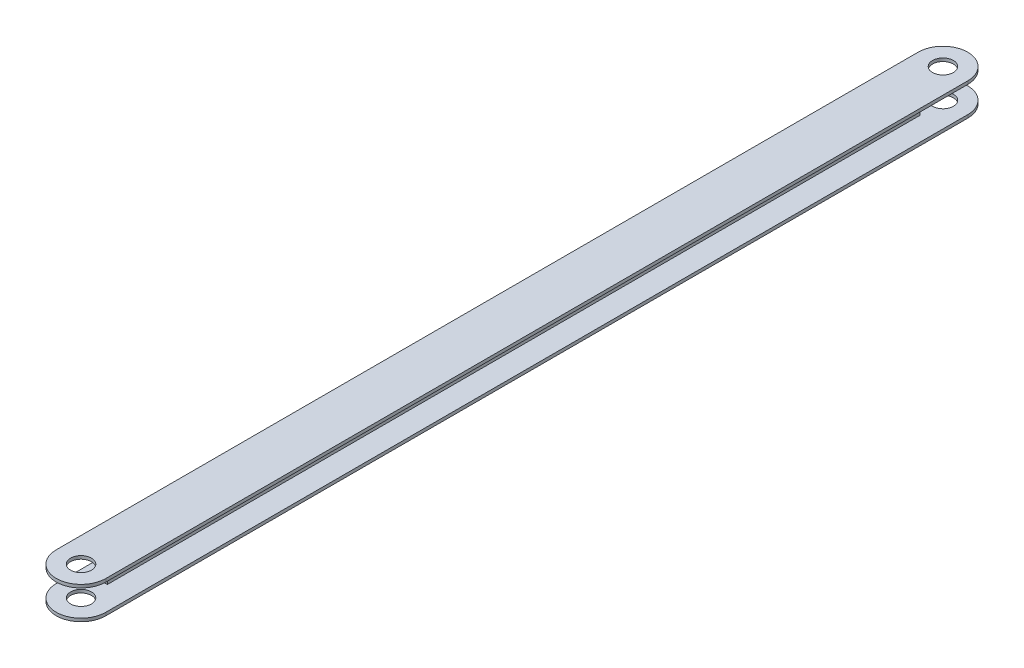
ISO-10303-21;
HEADER;
FILE_DESCRIPTION(('STEP AP214'),'2;1');
FILE_NAME('part.step','',(''),(''),'','','');
FILE_SCHEMA(('AUTOMOTIVE_DESIGN { 1 0 10303 214 1 1 1 1 }'));
ENDSEC;
DATA;
#1=APPLICATION_CONTEXT('core data for automotive mechanical design processes');
#2=APPLICATION_PROTOCOL_DEFINITION('international standard','automotive_design',2000,#1);
#3=PRODUCT_CONTEXT('',#1,'mechanical');
#4=PRODUCT('Part','Part','',(#3));
#5=PRODUCT_RELATED_PRODUCT_CATEGORY('part','',(#4));
#6=PRODUCT_DEFINITION_FORMATION('','',#4);
#7=PRODUCT_DEFINITION_CONTEXT('part definition',#1,'design');
#8=PRODUCT_DEFINITION('design','',#6,#7);
#9=PRODUCT_DEFINITION_SHAPE('','',#8);
#10=(LENGTH_UNIT() NAMED_UNIT(*) SI_UNIT(.MILLI.,.METRE.));
#11=(NAMED_UNIT(*) PLANE_ANGLE_UNIT() SI_UNIT($,.RADIAN.));
#12=(NAMED_UNIT(*) SI_UNIT($,.STERADIAN.) SOLID_ANGLE_UNIT());
#13=UNCERTAINTY_MEASURE_WITH_UNIT(LENGTH_MEASURE(1.E-05),#10,'distance_accuracy_value','');
#14=(GEOMETRIC_REPRESENTATION_CONTEXT(3) GLOBAL_UNCERTAINTY_ASSIGNED_CONTEXT((#13)) GLOBAL_UNIT_ASSIGNED_CONTEXT((#10,
#11,#12)) REPRESENTATION_CONTEXT('',''));
#15=CARTESIAN_POINT('',(0.,0.,0.));
#16=DIRECTION('',(0.,0.,1.));
#17=DIRECTION('',(1.,0.,0.));
#18=AXIS2_PLACEMENT_3D('',#15,#16,#17);
#19=CARTESIAN_POINT('',(-0.6,0.,349.));
#20=DIRECTION('',(1.,0.,0.));
#21=DIRECTION('',(0.,1.,0.));
#22=AXIS2_PLACEMENT_3D('',#19,#20,#21);
#23=PLANE('',#22);
#24=DIRECTION('',(0.,1.,0.));
#25=VECTOR('',#24,1.);
#26=CARTESIAN_POINT('',(-0.599999999999999,-5.,330.018966301083));
#27=LINE('',#26,#25);
#28=CARTESIAN_POINT('',(-0.599999999999999,-5.,330.018966301083));
#29=VERTEX_POINT('',#28);
#30=CARTESIAN_POINT('',(-0.6,5.00000000000001,330.018966301083));
#31=VERTEX_POINT('',#30);
#32=EDGE_CURVE('E162',#29,#31,#27,.T.);
#33=ORIENTED_EDGE('',*,*,#32,.T.);
#34=DIRECTION('',(0.,0.,-1.));
#35=VECTOR('',#34,1.);
#36=CARTESIAN_POINT('',(-0.6,5.,349.));
#37=LINE('',#36,#35);
#38=CARTESIAN_POINT('',(-0.6,5.00000000000001,18.981033698917));
#39=VERTEX_POINT('',#38);
#40=EDGE_CURVE('E77',#31,#39,#37,.T.);
#41=ORIENTED_EDGE('',*,*,#40,.T.);
#42=DIRECTION('',(0.,1.,0.));
#43=VECTOR('',#42,1.);
#44=CARTESIAN_POINT('',(-0.6,0.,18.981033698917));
#45=LINE('',#44,#43);
#46=CARTESIAN_POINT('',(-0.599999999999999,-5.,18.981033698917));
#47=VERTEX_POINT('',#46);
#48=EDGE_CURVE('E264',#47,#39,#45,.T.);
#49=ORIENTED_EDGE('',*,*,#48,.F.);
#50=DIRECTION('',(0.,0.,-1.));
#51=VECTOR('',#50,1.);
#52=CARTESIAN_POINT('',(-0.599999999999999,-5.,349.));
#53=LINE('',#52,#51);
#54=EDGE_CURVE('E174',#29,#47,#53,.T.);
#55=ORIENTED_EDGE('',*,*,#54,.F.);
#56=EDGE_LOOP('',(#33,#41,#49,#55));
#57=FACE_BOUND('',#56,.T.);
#58=ADVANCED_FACE('F69',(#57),#23,.F.);
#59=CARTESIAN_POINT('',(0.6,0.,349.));
#60=DIRECTION('',(1.,0.,0.));
#61=DIRECTION('',(0.,1.,0.));
#62=AXIS2_PLACEMENT_3D('',#59,#60,#61);
#63=PLANE('',#62);
#64=DIRECTION('',(0.,0.,-1.));
#65=VECTOR('',#64,1.);
#66=CARTESIAN_POINT('',(0.6,5.,349.));
#67=LINE('',#66,#65);
#68=CARTESIAN_POINT('',(0.599999999999989,5.00000000000001,330.018966301083));
#69=VERTEX_POINT('',#68);
#70=CARTESIAN_POINT('',(0.599999999999989,5.00000000000001,18.981033698917));
#71=VERTEX_POINT('',#70);
#72=EDGE_CURVE('E195',#69,#71,#67,.T.);
#73=ORIENTED_EDGE('',*,*,#72,.F.);
#74=DIRECTION('',(0.,-1.,0.));
#75=VECTOR('',#74,1.);
#76=CARTESIAN_POINT('',(0.599999999999989,5.00000000000001,330.018966301083));
#77=LINE('',#76,#75);
#78=CARTESIAN_POINT('',(0.599999999999989,-5.,330.018966301083));
#79=VERTEX_POINT('',#78);
#80=EDGE_CURVE('E165',#69,#79,#77,.T.);
#81=ORIENTED_EDGE('',*,*,#80,.T.);
#82=DIRECTION('',(0.,0.,-1.));
#83=VECTOR('',#82,1.);
#84=CARTESIAN_POINT('',(0.600000000000001,-5.,349.));
#85=LINE('',#84,#83);
#86=CARTESIAN_POINT('',(0.599999999999989,-5.,18.981033698917));
#87=VERTEX_POINT('',#86);
#88=EDGE_CURVE('E193',#79,#87,#85,.T.);
#89=ORIENTED_EDGE('',*,*,#88,.T.);
#90=DIRECTION('',(0.,-1.,0.));
#91=VECTOR('',#90,1.);
#92=CARTESIAN_POINT('',(0.6,1.14576392228436E-13,18.981033698917));
#93=LINE('',#92,#91);
#94=EDGE_CURVE('E258',#71,#87,#93,.T.);
#95=ORIENTED_EDGE('',*,*,#94,.F.);
#96=EDGE_LOOP('',(#73,#81,#89,#95));
#97=FACE_BOUND('',#96,.T.);
#98=ADVANCED_FACE('F274',(#97),#63,.T.);
#99=CARTESIAN_POINT('',(0.,-363.8,339.5));
#100=DIRECTION('',(0.,1.,0.));
#101=DIRECTION('',(0.,0.,1.));
#102=AXIS2_PLACEMENT_3D('',#99,#100,#101);
#103=CYLINDRICAL_SURFACE('',#102,9.49999999999999);
#104=CARTESIAN_POINT('',(0.,5.,339.5));
#105=DIRECTION('',(0.,1.,0.));
#106=DIRECTION('',(0.,0.,1.));
#107=AXIS2_PLACEMENT_3D('',#104,#105,#106);
#108=CIRCLE('',#107,9.49999999999999);
#109=CARTESIAN_POINT('',(9.5,5.,339.5));
#110=VERTEX_POINT('',#109);
#111=CARTESIAN_POINT('',(-9.49999999999999,5.,339.5));
#112=VERTEX_POINT('',#111);
#113=EDGE_CURVE('E84',#110,#112,#108,.F.);
#114=ORIENTED_EDGE('',*,*,#113,.F.);
#115=DIRECTION('',(0.,1.,0.));
#116=VECTOR('',#115,1.);
#117=CARTESIAN_POINT('',(9.5,-363.8,339.5));
#118=LINE('',#117,#116);
#119=CARTESIAN_POINT('',(9.5,6.2,339.5));
#120=VERTEX_POINT('',#119);
#121=EDGE_CURVE('E252',#110,#120,#118,.T.);
#122=ORIENTED_EDGE('',*,*,#121,.T.);
#123=CARTESIAN_POINT('',(0.,6.2,339.5));
#124=DIRECTION('',(0.,-1.,0.));
#125=DIRECTION('',(0.,0.,-1.));
#126=AXIS2_PLACEMENT_3D('',#123,#124,#125);
#127=CIRCLE('',#126,9.49999999999999);
#128=CARTESIAN_POINT('',(-9.49999999999999,6.2,339.5));
#129=VERTEX_POINT('',#128);
#130=EDGE_CURVE('E251',#120,#129,#127,.T.);
#131=ORIENTED_EDGE('',*,*,#130,.T.);
#132=DIRECTION('',(0.,1.,0.));
#133=VECTOR('',#132,1.);
#134=CARTESIAN_POINT('',(-9.49999999999999,-363.8,339.5));
#135=LINE('',#134,#133);
#136=EDGE_CURVE('E248',#112,#129,#135,.T.);
#137=ORIENTED_EDGE('',*,*,#136,.F.);
#138=EDGE_LOOP('',(#114,#122,#131,#137));
#139=FACE_BOUND('',#138,.T.);
#140=ADVANCED_FACE('F294',(#139),#103,.T.);
#141=CARTESIAN_POINT('',(0.,-363.8,339.5));
#142=DIRECTION('',(0.,1.,0.));
#143=DIRECTION('',(0.,0.,1.));
#144=AXIS2_PLACEMENT_3D('',#141,#142,#143);
#145=CYLINDRICAL_SURFACE('',#144,4.);
#146=CARTESIAN_POINT('',(0.,5.,339.5));
#147=DIRECTION('',(0.,1.,0.));
#148=DIRECTION('',(0.,0.,1.));
#149=AXIS2_PLACEMENT_3D('',#146,#147,#148);
#150=CIRCLE('',#149,4.);
#151=CARTESIAN_POINT('',(0.,5.,343.5));
#152=VERTEX_POINT('',#151);
#153=EDGE_CURVE('E232',#152,#152,#150,.F.);
#154=ORIENTED_EDGE('',*,*,#153,.T.);
#155=EDGE_LOOP('',(#154));
#156=FACE_BOUND('',#155,.T.);
#157=CARTESIAN_POINT('',(0.,6.2,339.5));
#158=DIRECTION('',(0.,-1.,0.));
#159=DIRECTION('',(0.,0.,-1.));
#160=AXIS2_PLACEMENT_3D('',#157,#158,#159);
#161=CIRCLE('',#160,4.);
#162=CARTESIAN_POINT('',(0.,6.2,335.5));
#163=VERTEX_POINT('',#162);
#164=EDGE_CURVE('E255',#163,#163,#161,.T.);
#165=ORIENTED_EDGE('',*,*,#164,.F.);
#166=EDGE_LOOP('',(#165));
#167=FACE_BOUND('',#166,.T.);
#168=ADVANCED_FACE('F289',(#156,#167),#145,.F.);
#169=CARTESIAN_POINT('',(0.,-363.8,9.5));
#170=DIRECTION('',(0.,1.,0.));
#171=DIRECTION('',(0.,0.,1.));
#172=AXIS2_PLACEMENT_3D('',#169,#170,#171);
#173=CYLINDRICAL_SURFACE('',#172,9.49999999999999);
#174=CARTESIAN_POINT('',(0.,5.,9.5));
#175=DIRECTION('',(0.,1.,0.));
#176=DIRECTION('',(0.,0.,1.));
#177=AXIS2_PLACEMENT_3D('',#174,#175,#176);
#178=CIRCLE('',#177,9.49999999999999);
#179=CARTESIAN_POINT('',(9.5,5.,9.5));
#180=VERTEX_POINT('',#179);
#181=CARTESIAN_POINT('',(-9.49999999999999,5.,9.5));
#182=VERTEX_POINT('',#181);
#183=EDGE_CURVE('E215',#180,#182,#178,.T.);
#184=ORIENTED_EDGE('',*,*,#183,.T.);
#185=DIRECTION('',(0.,1.,0.));
#186=VECTOR('',#185,1.);
#187=CARTESIAN_POINT('',(-9.49999999999999,-363.8,9.5));
#188=LINE('',#187,#186);
#189=CARTESIAN_POINT('',(-9.49999999999999,6.19999999999998,9.5));
#190=VERTEX_POINT('',#189);
#191=EDGE_CURVE('E225',#182,#190,#188,.T.);
#192=ORIENTED_EDGE('',*,*,#191,.T.);
#193=CARTESIAN_POINT('',(0.,6.2,9.5));
#194=DIRECTION('',(0.,1.,0.));
#195=DIRECTION('',(0.,0.,1.));
#196=AXIS2_PLACEMENT_3D('',#193,#194,#195);
#197=CIRCLE('',#196,9.49999999999999);
#198=CARTESIAN_POINT('',(9.5,6.2,9.5));
#199=VERTEX_POINT('',#198);
#200=EDGE_CURVE('E224',#199,#190,#197,.T.);
#201=ORIENTED_EDGE('',*,*,#200,.F.);
#202=DIRECTION('',(0.,1.,0.));
#203=VECTOR('',#202,1.);
#204=CARTESIAN_POINT('',(9.5,-363.8,9.5));
#205=LINE('',#204,#203);
#206=EDGE_CURVE('E220',#180,#199,#205,.T.);
#207=ORIENTED_EDGE('',*,*,#206,.F.);
#208=EDGE_LOOP('',(#184,#192,#201,#207));
#209=FACE_BOUND('',#208,.T.);
#210=ADVANCED_FACE('F323',(#209),#173,.T.);
#211=CARTESIAN_POINT('',(0.,-5.,9.5));
#212=DIRECTION('',(0.,1.,0.));
#213=DIRECTION('',(0.,0.,1.));
#214=AXIS2_PLACEMENT_3D('',#211,#212,#213);
#215=CIRCLE('',#214,9.49999999999999);
#216=CARTESIAN_POINT('',(9.5,-5.,9.5));
#217=VERTEX_POINT('',#216);
#218=CARTESIAN_POINT('',(-9.49999999999999,-5.,9.5));
#219=VERTEX_POINT('',#218);
#220=EDGE_CURVE('E211',#217,#219,#215,.T.);
#221=ORIENTED_EDGE('',*,*,#220,.F.);
#222=CARTESIAN_POINT('',(9.5,-6.19999999999998,9.5));
#223=VERTEX_POINT('',#222);
#224=EDGE_CURVE('E223',#223,#217,#205,.T.);
#225=ORIENTED_EDGE('',*,*,#224,.F.);
#226=CARTESIAN_POINT('',(0.,-6.19999999999998,9.5));
#227=DIRECTION('',(0.,1.,0.));
#228=DIRECTION('',(0.,0.,1.));
#229=AXIS2_PLACEMENT_3D('',#226,#227,#228);
#230=CIRCLE('',#229,9.49999999999999);
#231=CARTESIAN_POINT('',(-9.49999999999999,-6.19999999999998,9.5));
#232=VERTEX_POINT('',#231);
#233=EDGE_CURVE('E214',#223,#232,#230,.T.);
#234=ORIENTED_EDGE('',*,*,#233,.T.);
#235=EDGE_CURVE('E217',#232,#219,#188,.T.);
#236=ORIENTED_EDGE('',*,*,#235,.T.);
#237=EDGE_LOOP('',(#221,#225,#234,#236));
#238=FACE_BOUND('',#237,.T.);
#239=ADVANCED_FACE('F326',(#238),#173,.T.);
#240=CARTESIAN_POINT('',(0.,-363.8,9.5));
#241=DIRECTION('',(0.,1.,0.));
#242=DIRECTION('',(0.,0.,1.));
#243=AXIS2_PLACEMENT_3D('',#240,#241,#242);
#244=CYLINDRICAL_SURFACE('',#243,4.);
#245=CARTESIAN_POINT('',(0.,-6.19999999999998,9.5));
#246=DIRECTION('',(0.,1.,0.));
#247=DIRECTION('',(0.,0.,1.));
#248=AXIS2_PLACEMENT_3D('',#245,#246,#247);
#249=CIRCLE('',#248,4.);
#250=CARTESIAN_POINT('',(0.,-6.19999999999998,13.5));
#251=VERTEX_POINT('',#250);
#252=EDGE_CURVE('E205',#251,#251,#249,.T.);
#253=ORIENTED_EDGE('',*,*,#252,.F.);
#254=EDGE_LOOP('',(#253));
#255=FACE_BOUND('',#254,.T.);
#256=CARTESIAN_POINT('',(0.,-5.,9.5));
#257=DIRECTION('',(0.,1.,0.));
#258=DIRECTION('',(0.,0.,1.));
#259=AXIS2_PLACEMENT_3D('',#256,#257,#258);
#260=CIRCLE('',#259,4.);
#261=CARTESIAN_POINT('',(0.,-5.,13.5));
#262=VERTEX_POINT('',#261);
#263=EDGE_CURVE('E202',#262,#262,#260,.T.);
#264=ORIENTED_EDGE('',*,*,#263,.T.);
#265=EDGE_LOOP('',(#264));
#266=FACE_BOUND('',#265,.T.);
#267=ADVANCED_FACE('F305',(#255,#266),#244,.F.);
#268=CARTESIAN_POINT('',(0.,-6.2,349.));
#269=DIRECTION('',(0.,1.,0.));
#270=DIRECTION('',(0.,0.,1.));
#271=AXIS2_PLACEMENT_3D('',#268,#269,#270);
#272=PLANE('',#271);
#273=CARTESIAN_POINT('',(0.,-6.19999999999998,339.5));
#274=DIRECTION('',(0.,1.,0.));
#275=DIRECTION('',(0.,0.,1.));
#276=AXIS2_PLACEMENT_3D('',#273,#274,#275);
#277=CIRCLE('',#276,4.);
#278=CARTESIAN_POINT('',(0.,-6.19999999999998,343.5));
#279=VERTEX_POINT('',#278);
#280=EDGE_CURVE('E235',#279,#279,#277,.F.);
#281=ORIENTED_EDGE('',*,*,#280,.F.);
#282=EDGE_LOOP('',(#281));
#283=FACE_BOUND('',#282,.T.);
#284=ORIENTED_EDGE('',*,*,#252,.T.);
#285=EDGE_LOOP('',(#284));
#286=FACE_BOUND('',#285,.T.);
#287=DIRECTION('',(0.,0.,-1.));
#288=VECTOR('',#287,1.);
#289=CARTESIAN_POINT('',(9.5,-6.2,349.));
#290=LINE('',#289,#288);
#291=CARTESIAN_POINT('',(9.5,-6.19999999999998,339.5));
#292=VERTEX_POINT('',#291);
#293=EDGE_CURVE('E188',#292,#223,#290,.T.);
#294=ORIENTED_EDGE('',*,*,#293,.F.);
#295=CARTESIAN_POINT('',(0.,-6.19999999999998,339.5));
#296=DIRECTION('',(0.,1.,0.));
#297=DIRECTION('',(0.,0.,1.));
#298=AXIS2_PLACEMENT_3D('',#295,#296,#297);
#299=CIRCLE('',#298,9.49999999999999);
#300=CARTESIAN_POINT('',(-9.49999999999999,-6.19999999999998,339.5));
#301=VERTEX_POINT('',#300);
#302=EDGE_CURVE('E244',#292,#301,#299,.F.);
#303=ORIENTED_EDGE('',*,*,#302,.T.);
#304=DIRECTION('',(0.,0.,-1.));
#305=VECTOR('',#304,1.);
#306=CARTESIAN_POINT('',(-9.5,-6.2,349.));
#307=LINE('',#306,#305);
#308=EDGE_CURVE('E186',#301,#232,#307,.T.);
#309=ORIENTED_EDGE('',*,*,#308,.T.);
#310=ORIENTED_EDGE('',*,*,#233,.F.);
#311=EDGE_LOOP('',(#294,#303,#309,#310));
#312=FACE_BOUND('',#311,.T.);
#313=ADVANCED_FACE('F302',(#283,#286,#312),#272,.F.);
#314=CARTESIAN_POINT('',(0.,-5.,349.));
#315=DIRECTION('',(0.,1.,0.));
#316=DIRECTION('',(0.,0.,1.));
#317=AXIS2_PLACEMENT_3D('',#314,#315,#316);
#318=PLANE('',#317);
#319=DIRECTION('',(-1.,0.,0.));
#320=VECTOR('',#319,1.);
#321=CARTESIAN_POINT('',(0.599999999999989,-5.,330.018966301083));
#322=LINE('',#321,#320);
#323=EDGE_CURVE('E175',#79,#29,#322,.T.);
#324=ORIENTED_EDGE('',*,*,#323,.T.);
#325=ORIENTED_EDGE('',*,*,#54,.T.);
#326=DIRECTION('',(-1.,0.,0.));
#327=VECTOR('',#326,1.);
#328=CARTESIAN_POINT('',(369.4,-4.99999999999996,18.981033698917));
#329=LINE('',#328,#327);
#330=EDGE_CURVE('E261',#87,#47,#329,.T.);
#331=ORIENTED_EDGE('',*,*,#330,.F.);
#332=ORIENTED_EDGE('',*,*,#88,.F.);
#333=EDGE_LOOP('',(#324,#325,#331,#332));
#334=FACE_BOUND('',#333,.T.);
#335=CARTESIAN_POINT('',(0.,-5.,339.5));
#336=DIRECTION('',(0.,1.,0.));
#337=DIRECTION('',(0.,0.,1.));
#338=AXIS2_PLACEMENT_3D('',#335,#336,#337);
#339=CIRCLE('',#338,4.);
#340=CARTESIAN_POINT('',(0.,-5.,343.5));
#341=VERTEX_POINT('',#340);
#342=EDGE_CURVE('E238',#341,#341,#339,.F.);
#343=ORIENTED_EDGE('',*,*,#342,.T.);
#344=EDGE_LOOP('',(#343));
#345=FACE_BOUND('',#344,.T.);
#346=ORIENTED_EDGE('',*,*,#263,.F.);
#347=EDGE_LOOP('',(#346));
#348=FACE_BOUND('',#347,.T.);
#349=CARTESIAN_POINT('',(0.,-5.,339.5));
#350=DIRECTION('',(0.,1.,0.));
#351=DIRECTION('',(0.,0.,1.));
#352=AXIS2_PLACEMENT_3D('',#349,#350,#351);
#353=CIRCLE('',#352,9.49999999999999);
#354=CARTESIAN_POINT('',(9.5,-5.,339.5));
#355=VERTEX_POINT('',#354);
#356=CARTESIAN_POINT('',(-9.49999999999999,-5.,339.5));
#357=VERTEX_POINT('',#356);
#358=EDGE_CURVE('E242',#355,#357,#353,.F.);
#359=ORIENTED_EDGE('',*,*,#358,.F.);
#360=DIRECTION('',(0.,0.,-1.));
#361=VECTOR('',#360,1.);
#362=CARTESIAN_POINT('',(9.5,-5.,349.));
#363=LINE('',#362,#361);
#364=EDGE_CURVE('E190',#355,#217,#363,.T.);
#365=ORIENTED_EDGE('',*,*,#364,.T.);
#366=ORIENTED_EDGE('',*,*,#220,.T.);
#367=DIRECTION('',(0.,0.,-1.));
#368=VECTOR('',#367,1.);
#369=CARTESIAN_POINT('',(-9.5,-5.,349.));
#370=LINE('',#369,#368);
#371=EDGE_CURVE('E182',#357,#219,#370,.T.);
#372=ORIENTED_EDGE('',*,*,#371,.F.);
#373=EDGE_LOOP('',(#359,#365,#366,#372));
#374=FACE_BOUND('',#373,.T.);
#375=ADVANCED_FACE('F270',(#334,#345,#348,#374),#318,.T.);
#376=CARTESIAN_POINT('',(0.,5.,349.));
#377=DIRECTION('',(0.,1.,0.));
#378=DIRECTION('',(0.,0.,1.));
#379=AXIS2_PLACEMENT_3D('',#376,#377,#378);
#380=PLANE('',#379);
#381=ORIENTED_EDGE('',*,*,#40,.F.);
#382=DIRECTION('',(1.,0.,0.));
#383=VECTOR('',#382,1.);
#384=CARTESIAN_POINT('',(-0.6,5.00000000000001,330.018966301083));
#385=LINE('',#384,#383);
#386=EDGE_CURVE('E159',#31,#69,#385,.T.);
#387=ORIENTED_EDGE('',*,*,#386,.T.);
#388=ORIENTED_EDGE('',*,*,#72,.T.);
#389=DIRECTION('',(-1.,0.,0.));
#390=VECTOR('',#389,1.);
#391=CARTESIAN_POINT('',(369.4,5.00000000000005,18.981033698917));
#392=LINE('',#391,#390);
#393=EDGE_CURVE('E180',#71,#39,#392,.T.);
#394=ORIENTED_EDGE('',*,*,#393,.T.);
#395=EDGE_LOOP('',(#381,#387,#388,#394));
#396=FACE_BOUND('',#395,.T.);
#397=ORIENTED_EDGE('',*,*,#153,.F.);
#398=EDGE_LOOP('',(#397));
#399=FACE_BOUND('',#398,.T.);
#400=CARTESIAN_POINT('',(0.,5.,9.5));
#401=DIRECTION('',(0.,1.,0.));
#402=DIRECTION('',(0.,0.,1.));
#403=AXIS2_PLACEMENT_3D('',#400,#401,#402);
#404=CIRCLE('',#403,4.);
#405=CARTESIAN_POINT('',(0.,5.,13.5));
#406=VERTEX_POINT('',#405);
#407=EDGE_CURVE('E208',#406,#406,#404,.T.);
#408=ORIENTED_EDGE('',*,*,#407,.T.);
#409=EDGE_LOOP('',(#408));
#410=FACE_BOUND('',#409,.T.);
#411=DIRECTION('',(0.,0.,-1.));
#412=VECTOR('',#411,1.);
#413=CARTESIAN_POINT('',(-9.49999999999999,5.,349.));
#414=LINE('',#413,#412);
#415=EDGE_CURVE('E12',#112,#182,#414,.T.);
#416=ORIENTED_EDGE('',*,*,#415,.T.);
#417=ORIENTED_EDGE('',*,*,#183,.F.);
#418=DIRECTION('',(0.,0.,-1.));
#419=VECTOR('',#418,1.);
#420=CARTESIAN_POINT('',(9.5,5.,349.));
#421=LINE('',#420,#419);
#422=EDGE_CURVE('E197',#110,#180,#421,.T.);
#423=ORIENTED_EDGE('',*,*,#422,.F.);
#424=ORIENTED_EDGE('',*,*,#113,.T.);
#425=EDGE_LOOP('',(#416,#417,#423,#424));
#426=FACE_BOUND('',#425,.T.);
#427=ADVANCED_FACE('F177',(#396,#399,#410,#426),#380,.F.);
#428=CARTESIAN_POINT('',(0.,6.2,349.));
#429=DIRECTION('',(0.,1.,0.));
#430=DIRECTION('',(0.,0.,1.));
#431=AXIS2_PLACEMENT_3D('',#428,#429,#430);
#432=PLANE('',#431);
#433=ORIENTED_EDGE('',*,*,#164,.T.);
#434=EDGE_LOOP('',(#433));
#435=FACE_BOUND('',#434,.T.);
#436=CARTESIAN_POINT('',(0.,6.2,9.5));
#437=DIRECTION('',(0.,1.,0.));
#438=DIRECTION('',(0.,0.,1.));
#439=AXIS2_PLACEMENT_3D('',#436,#437,#438);
#440=CIRCLE('',#439,4.);
#441=CARTESIAN_POINT('',(0.,6.2,13.5));
#442=VERTEX_POINT('',#441);
#443=EDGE_CURVE('E229',#442,#442,#440,.T.);
#444=ORIENTED_EDGE('',*,*,#443,.F.);
#445=EDGE_LOOP('',(#444));
#446=FACE_BOUND('',#445,.T.);
#447=DIRECTION('',(0.,0.,-1.));
#448=VECTOR('',#447,1.);
#449=CARTESIAN_POINT('',(-9.49999999999999,6.2,349.));
#450=LINE('',#449,#448);
#451=EDGE_CURVE('E92',#129,#190,#450,.T.);
#452=ORIENTED_EDGE('',*,*,#451,.F.);
#453=ORIENTED_EDGE('',*,*,#130,.F.);
#454=DIRECTION('',(0.,0.,-1.));
#455=VECTOR('',#454,1.);
#456=CARTESIAN_POINT('',(9.5,6.2,349.));
#457=LINE('',#456,#455);
#458=EDGE_CURVE('E199',#120,#199,#457,.T.);
#459=ORIENTED_EDGE('',*,*,#458,.T.);
#460=ORIENTED_EDGE('',*,*,#200,.T.);
#461=EDGE_LOOP('',(#452,#453,#459,#460));
#462=FACE_BOUND('',#461,.T.);
#463=ADVANCED_FACE('F315',(#435,#446,#462),#432,.T.);
#464=CARTESIAN_POINT('',(-9.5,0.,349.));
#465=DIRECTION('',(-1.,0.,0.));
#466=DIRECTION('',(0.,-1.,0.));
#467=AXIS2_PLACEMENT_3D('',#464,#465,#466);
#468=PLANE('',#467);
#469=ORIENTED_EDGE('',*,*,#415,.F.);
#470=ORIENTED_EDGE('',*,*,#136,.T.);
#471=ORIENTED_EDGE('',*,*,#451,.T.);
#472=ORIENTED_EDGE('',*,*,#191,.F.);
#473=EDGE_LOOP('',(#469,#470,#471,#472));
#474=FACE_BOUND('',#473,.T.);
#475=ADVANCED_FACE('F71',(#474),#468,.T.);
#476=CARTESIAN_POINT('',(-9.50000000000001,0.,349.));
#477=DIRECTION('',(1.,0.,0.));
#478=DIRECTION('',(0.,1.,0.));
#479=AXIS2_PLACEMENT_3D('',#476,#477,#478);
#480=PLANE('',#479);
#481=EDGE_CURVE('E250',#301,#357,#135,.T.);
#482=ORIENTED_EDGE('',*,*,#481,.T.);
#483=ORIENTED_EDGE('',*,*,#371,.T.);
#484=ORIENTED_EDGE('',*,*,#235,.F.);
#485=ORIENTED_EDGE('',*,*,#308,.F.);
#486=EDGE_LOOP('',(#482,#483,#484,#485));
#487=FACE_BOUND('',#486,.T.);
#488=ADVANCED_FACE('F297',(#487),#480,.F.);
#489=CARTESIAN_POINT('',(9.5,0.,349.));
#490=DIRECTION('',(1.,0.,0.));
#491=DIRECTION('',(0.,0.,-1.));
#492=AXIS2_PLACEMENT_3D('',#489,#490,#491);
#493=PLANE('',#492);
#494=ORIENTED_EDGE('',*,*,#364,.F.);
#495=EDGE_CURVE('E247',#292,#355,#118,.T.);
#496=ORIENTED_EDGE('',*,*,#495,.F.);
#497=ORIENTED_EDGE('',*,*,#293,.T.);
#498=ORIENTED_EDGE('',*,*,#224,.T.);
#499=EDGE_LOOP('',(#494,#496,#497,#498));
#500=FACE_BOUND('',#499,.T.);
#501=ADVANCED_FACE('F300',(#500),#493,.T.);
#502=CARTESIAN_POINT('',(9.5,0.,349.));
#503=DIRECTION('',(-1.,0.,0.));
#504=DIRECTION('',(0.,0.,1.));
#505=AXIS2_PLACEMENT_3D('',#502,#503,#504);
#506=PLANE('',#505);
#507=ORIENTED_EDGE('',*,*,#121,.F.);
#508=ORIENTED_EDGE('',*,*,#422,.T.);
#509=ORIENTED_EDGE('',*,*,#206,.T.);
#510=ORIENTED_EDGE('',*,*,#458,.F.);
#511=EDGE_LOOP('',(#507,#508,#509,#510));
#512=FACE_BOUND('',#511,.T.);
#513=ADVANCED_FACE('F309',(#512),#506,.F.);
#514=ORIENTED_EDGE('',*,*,#443,.T.);
#515=EDGE_LOOP('',(#514));
#516=FACE_BOUND('',#515,.T.);
#517=ORIENTED_EDGE('',*,*,#407,.F.);
#518=EDGE_LOOP('',(#517));
#519=FACE_BOUND('',#518,.T.);
#520=ADVANCED_FACE('F318',(#516,#519),#244,.F.);
#521=ORIENTED_EDGE('',*,*,#495,.T.);
#522=ORIENTED_EDGE('',*,*,#358,.T.);
#523=ORIENTED_EDGE('',*,*,#481,.F.);
#524=ORIENTED_EDGE('',*,*,#302,.F.);
#525=EDGE_LOOP('',(#521,#522,#523,#524));
#526=FACE_BOUND('',#525,.T.);
#527=ADVANCED_FACE('F286',(#526),#103,.T.);
#528=ORIENTED_EDGE('',*,*,#342,.F.);
#529=EDGE_LOOP('',(#528));
#530=FACE_BOUND('',#529,.T.);
#531=ORIENTED_EDGE('',*,*,#280,.T.);
#532=EDGE_LOOP('',(#531));
#533=FACE_BOUND('',#532,.T.);
#534=ADVANCED_FACE('F279',(#530,#533),#145,.F.);
#535=CARTESIAN_POINT('',(369.4,0.,18.981033698917));
#536=DIRECTION('',(0.,0.,1.));
#537=DIRECTION('',(0.,-1.,0.));
#538=AXIS2_PLACEMENT_3D('',#535,#536,#537);
#539=PLANE('',#538);
#540=ORIENTED_EDGE('',*,*,#94,.T.);
#541=ORIENTED_EDGE('',*,*,#330,.T.);
#542=ORIENTED_EDGE('',*,*,#48,.T.);
#543=ORIENTED_EDGE('',*,*,#393,.F.);
#544=EDGE_LOOP('',(#540,#541,#542,#543));
#545=FACE_BOUND('',#544,.T.);
#546=ADVANCED_FACE('F277',(#545),#539,.F.);
#547=CARTESIAN_POINT('',(0.,0.,330.018966301083));
#548=DIRECTION('',(0.,0.,1.));
#549=DIRECTION('',(0.,1.,0.));
#550=AXIS2_PLACEMENT_3D('',#547,#548,#549);
#551=PLANE('',#550);
#552=ORIENTED_EDGE('',*,*,#386,.F.);
#553=ORIENTED_EDGE('',*,*,#32,.F.);
#554=ORIENTED_EDGE('',*,*,#323,.F.);
#555=ORIENTED_EDGE('',*,*,#80,.F.);
#556=EDGE_LOOP('',(#552,#553,#554,#555));
#557=FACE_BOUND('',#556,.T.);
#558=ADVANCED_FACE('F161',(#557),#551,.T.);
#559=CLOSED_SHELL('',(#58,#98,#140,#168,#210,#239,#267,#313,#375,#427,#463,#475,#488,#501,#513,
#520,#527,#534,#546,#558));
#560=MANIFOLD_SOLID_BREP('B2',#559);
#561=ADVANCED_BREP_SHAPE_REPRESENTATION('',(#18,#560),#14);
#562=SHAPE_DEFINITION_REPRESENTATION(#9,#561);
ENDSEC;
END-ISO-10303-21;
